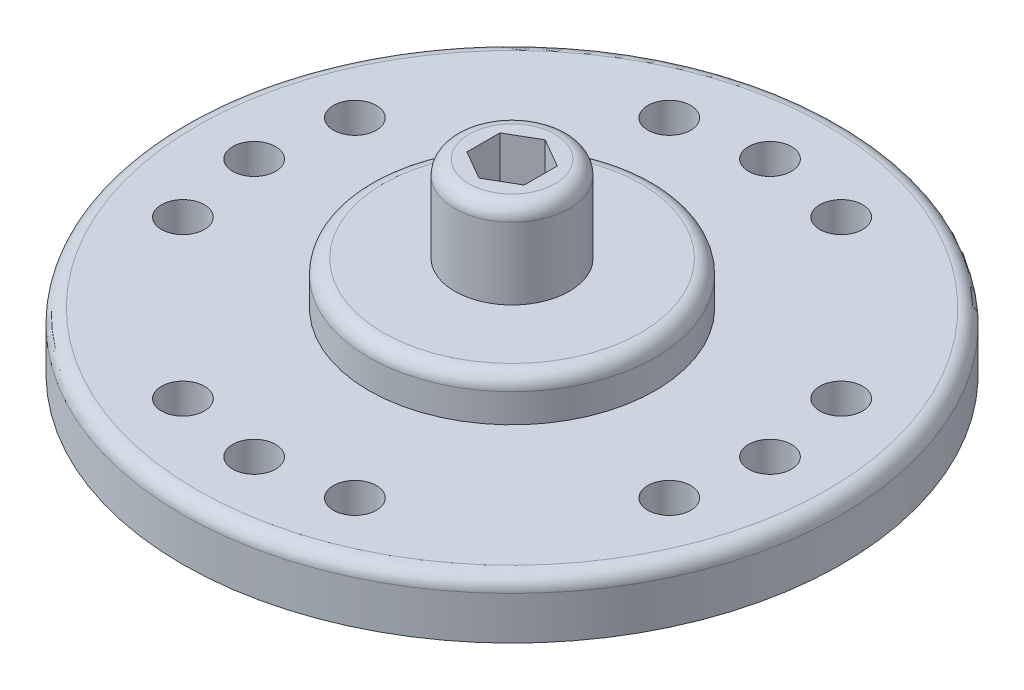
ISO-10303-21;
HEADER;
FILE_DESCRIPTION(('STEP AP214'),'2;1');
FILE_NAME('part.step','',(''),(''),'','','');
FILE_SCHEMA(('AUTOMOTIVE_DESIGN { 1 0 10303 214 1 1 1 1 }'));
ENDSEC;
DATA;
#1=APPLICATION_CONTEXT('core data for automotive mechanical design processes');
#2=APPLICATION_PROTOCOL_DEFINITION('international standard','automotive_design',2000,#1);
#3=PRODUCT_CONTEXT('',#1,'mechanical');
#4=PRODUCT('Part','Part','',(#3));
#5=PRODUCT_RELATED_PRODUCT_CATEGORY('part','',(#4));
#6=PRODUCT_DEFINITION_FORMATION('','',#4);
#7=PRODUCT_DEFINITION_CONTEXT('part definition',#1,'design');
#8=PRODUCT_DEFINITION('design','',#6,#7);
#9=PRODUCT_DEFINITION_SHAPE('','',#8);
#10=(LENGTH_UNIT() NAMED_UNIT(*) SI_UNIT(.MILLI.,.METRE.));
#11=(NAMED_UNIT(*) PLANE_ANGLE_UNIT() SI_UNIT($,.RADIAN.));
#12=(NAMED_UNIT(*) SI_UNIT($,.STERADIAN.) SOLID_ANGLE_UNIT());
#13=UNCERTAINTY_MEASURE_WITH_UNIT(LENGTH_MEASURE(1.E-05),#10,'distance_accuracy_value','');
#14=(GEOMETRIC_REPRESENTATION_CONTEXT(3) GLOBAL_UNCERTAINTY_ASSIGNED_CONTEXT((#13)) GLOBAL_UNIT_ASSIGNED_CONTEXT((#10,
#11,#12)) REPRESENTATION_CONTEXT('',''));
#15=CARTESIAN_POINT('',(0.,0.,0.));
#16=DIRECTION('',(0.,0.,1.));
#17=DIRECTION('',(1.,0.,0.));
#18=AXIS2_PLACEMENT_3D('',#15,#16,#17);
#19=CARTESIAN_POINT('',(0.,3.5,-13.3));
#20=DIRECTION('',(0.,1.,0.));
#21=DIRECTION('',(0.,0.,1.));
#22=AXIS2_PLACEMENT_3D('',#19,#20,#21);
#23=PLANE('',#22);
#24=CARTESIAN_POINT('',(0.,3.5,-13.3));
#25=DIRECTION('',(0.,1.,0.));
#26=DIRECTION('',(0.,0.,1.));
#27=AXIS2_PLACEMENT_3D('',#24,#25,#26);
#28=CIRCLE('',#27,4.5);
#29=CARTESIAN_POINT('',(0.,3.5,-8.79999999999999));
#30=VERTEX_POINT('',#29);
#31=EDGE_CURVE('E251',#30,#30,#28,.T.);
#32=ORIENTED_EDGE('',*,*,#31,.T.);
#33=EDGE_LOOP('',(#32));
#34=FACE_BOUND('',#33,.T.);
#35=CARTESIAN_POINT('',(0.,3.5,-13.3));
#36=DIRECTION('',(0.,1.,0.));
#37=DIRECTION('',(0.,0.,1.));
#38=AXIS2_PLACEMENT_3D('',#35,#36,#37);
#39=CIRCLE('',#38,2.);
#40=CARTESIAN_POINT('',(0.,3.5,-11.3));
#41=VERTEX_POINT('',#40);
#42=EDGE_CURVE('E157',#41,#41,#39,.T.);
#43=ORIENTED_EDGE('',*,*,#42,.F.);
#44=EDGE_LOOP('',(#43));
#45=FACE_BOUND('',#44,.T.);
#46=ADVANCED_FACE('F56',(#34,#45),#23,.T.);
#47=CARTESIAN_POINT('',(0.,2.,-13.3));
#48=DIRECTION('',(0.,1.,0.));
#49=DIRECTION('',(0.,0.,1.));
#50=AXIS2_PLACEMENT_3D('',#47,#48,#49);
#51=PLANE('',#50);
#52=CARTESIAN_POINT('',(0.,2.,-13.3));
#53=DIRECTION('',(0.,1.,0.));
#54=DIRECTION('',(0.,0.,1.));
#55=AXIS2_PLACEMENT_3D('',#52,#53,#54);
#56=CIRCLE('',#55,11.);
#57=CARTESIAN_POINT('',(0.,2.,-2.3));
#58=VERTEX_POINT('',#57);
#59=EDGE_CURVE('E257',#58,#58,#56,.T.);
#60=ORIENTED_EDGE('',*,*,#59,.T.);
#61=EDGE_LOOP('',(#60));
#62=FACE_BOUND('',#61,.T.);
#63=CARTESIAN_POINT('',(8.48528137423861,2.,-10.3000000000001));
#64=DIRECTION('',(0.,1.,0.));
#65=DIRECTION('',(0.,0.,1.));
#66=AXIS2_PLACEMENT_3D('',#63,#64,#65);
#67=CIRCLE('',#66,0.75);
#68=CARTESIAN_POINT('',(8.48528137423861,2.,-9.55000000000008));
#69=VERTEX_POINT('',#68);
#70=EDGE_CURVE('E179',#69,#69,#67,.F.);
#71=ORIENTED_EDGE('',*,*,#70,.T.);
#72=EDGE_LOOP('',(#71));
#73=FACE_BOUND('',#72,.T.);
#74=CARTESIAN_POINT('',(-3.,2.,-4.81471862576142));
#75=DIRECTION('',(0.,1.,0.));
#76=DIRECTION('',(0.,0.,1.));
#77=AXIS2_PLACEMENT_3D('',#74,#75,#76);
#78=CIRCLE('',#77,0.75);
#79=CARTESIAN_POINT('',(-3.,2.,-4.06471862576142));
#80=VERTEX_POINT('',#79);
#81=EDGE_CURVE('E197',#80,#80,#78,.F.);
#82=ORIENTED_EDGE('',*,*,#81,.T.);
#83=EDGE_LOOP('',(#82));
#84=FACE_BOUND('',#83,.T.);
#85=CARTESIAN_POINT('',(-8.48528137423858,2.,-16.3));
#86=DIRECTION('',(0.,1.,0.));
#87=DIRECTION('',(0.,0.,1.));
#88=AXIS2_PLACEMENT_3D('',#85,#86,#87);
#89=CIRCLE('',#88,0.75);
#90=CARTESIAN_POINT('',(-8.48528137423858,2.,-15.55));
#91=VERTEX_POINT('',#90);
#92=EDGE_CURVE('E215',#91,#91,#89,.F.);
#93=ORIENTED_EDGE('',*,*,#92,.T.);
#94=EDGE_LOOP('',(#93));
#95=FACE_BOUND('',#94,.T.);
#96=CARTESIAN_POINT('',(3.,2.,-21.7852813742386));
#97=DIRECTION('',(0.,1.,0.));
#98=DIRECTION('',(0.,0.,1.));
#99=AXIS2_PLACEMENT_3D('',#96,#97,#98);
#100=CIRCLE('',#99,0.75);
#101=CARTESIAN_POINT('',(3.,2.,-21.0352813742386));
#102=VERTEX_POINT('',#101);
#103=EDGE_CURVE('E233',#102,#102,#100,.F.);
#104=ORIENTED_EDGE('',*,*,#103,.T.);
#105=EDGE_LOOP('',(#104));
#106=FACE_BOUND('',#105,.T.);
#107=CARTESIAN_POINT('',(0.,2.,-22.3));
#108=DIRECTION('',(0.,1.,0.));
#109=DIRECTION('',(0.,0.,1.));
#110=AXIS2_PLACEMENT_3D('',#107,#108,#109);
#111=CIRCLE('',#110,0.750000000000001);
#112=CARTESIAN_POINT('',(0.,2.,-21.55));
#113=VERTEX_POINT('',#112);
#114=EDGE_CURVE('E239',#113,#113,#111,.F.);
#115=ORIENTED_EDGE('',*,*,#114,.T.);
#116=EDGE_LOOP('',(#115));
#117=FACE_BOUND('',#116,.T.);
#118=CARTESIAN_POINT('',(-3.,2.,-21.7852813742386));
#119=DIRECTION('',(0.,1.,0.));
#120=DIRECTION('',(0.,0.,1.));
#121=AXIS2_PLACEMENT_3D('',#118,#119,#120);
#122=CIRCLE('',#121,0.75);
#123=CARTESIAN_POINT('',(-3.,2.,-21.0352813742386));
#124=VERTEX_POINT('',#123);
#125=EDGE_CURVE('E227',#124,#124,#122,.T.);
#126=ORIENTED_EDGE('',*,*,#125,.F.);
#127=EDGE_LOOP('',(#126));
#128=FACE_BOUND('',#127,.T.);
#129=CARTESIAN_POINT('',(-9.,2.,-13.3));
#130=DIRECTION('',(0.,1.,0.));
#131=DIRECTION('',(0.,0.,1.));
#132=AXIS2_PLACEMENT_3D('',#129,#130,#131);
#133=CIRCLE('',#132,0.750000000000001);
#134=CARTESIAN_POINT('',(-9.,2.,-12.55));
#135=VERTEX_POINT('',#134);
#136=EDGE_CURVE('E221',#135,#135,#133,.F.);
#137=ORIENTED_EDGE('',*,*,#136,.T.);
#138=EDGE_LOOP('',(#137));
#139=FACE_BOUND('',#138,.T.);
#140=CARTESIAN_POINT('',(-8.48528137423856,2.,-10.3));
#141=DIRECTION('',(0.,1.,0.));
#142=DIRECTION('',(0.,0.,1.));
#143=AXIS2_PLACEMENT_3D('',#140,#141,#142);
#144=CIRCLE('',#143,0.75);
#145=CARTESIAN_POINT('',(-8.48528137423856,2.,-9.54999999999997));
#146=VERTEX_POINT('',#145);
#147=EDGE_CURVE('E209',#146,#146,#144,.T.);
#148=ORIENTED_EDGE('',*,*,#147,.F.);
#149=EDGE_LOOP('',(#148));
#150=FACE_BOUND('',#149,.T.);
#151=CARTESIAN_POINT('',(0.,2.,-4.3));
#152=DIRECTION('',(0.,1.,0.));
#153=DIRECTION('',(0.,0.,1.));
#154=AXIS2_PLACEMENT_3D('',#151,#152,#153);
#155=CIRCLE('',#154,0.750000000000001);
#156=CARTESIAN_POINT('',(0.,2.,-3.55));
#157=VERTEX_POINT('',#156);
#158=EDGE_CURVE('E203',#157,#157,#155,.F.);
#159=ORIENTED_EDGE('',*,*,#158,.T.);
#160=EDGE_LOOP('',(#159));
#161=FACE_BOUND('',#160,.T.);
#162=CARTESIAN_POINT('',(3.,2.,-4.81471862576142));
#163=DIRECTION('',(0.,1.,0.));
#164=DIRECTION('',(0.,0.,1.));
#165=AXIS2_PLACEMENT_3D('',#162,#163,#164);
#166=CIRCLE('',#165,0.75);
#167=CARTESIAN_POINT('',(3.,2.,-4.06471862576142));
#168=VERTEX_POINT('',#167);
#169=EDGE_CURVE('E191',#168,#168,#166,.T.);
#170=ORIENTED_EDGE('',*,*,#169,.F.);
#171=EDGE_LOOP('',(#170));
#172=FACE_BOUND('',#171,.T.);
#173=CARTESIAN_POINT('',(9.,2.,-13.3000000000001));
#174=DIRECTION('',(0.,1.,0.));
#175=DIRECTION('',(0.,0.,1.));
#176=AXIS2_PLACEMENT_3D('',#173,#174,#175);
#177=CIRCLE('',#176,0.750000000000001);
#178=CARTESIAN_POINT('',(9.,2.,-12.5500000000001));
#179=VERTEX_POINT('',#178);
#180=EDGE_CURVE('E185',#179,#179,#177,.F.);
#181=ORIENTED_EDGE('',*,*,#180,.T.);
#182=EDGE_LOOP('',(#181));
#183=FACE_BOUND('',#182,.T.);
#184=CARTESIAN_POINT('',(8.48528137423854,2.,-16.3000000000001));
#185=DIRECTION('',(0.,1.,0.));
#186=DIRECTION('',(0.,0.,1.));
#187=AXIS2_PLACEMENT_3D('',#184,#185,#186);
#188=CIRCLE('',#187,0.75);
#189=CARTESIAN_POINT('',(8.48528137423854,2.,-15.5500000000001));
#190=VERTEX_POINT('',#189);
#191=EDGE_CURVE('E173',#190,#190,#188,.T.);
#192=ORIENTED_EDGE('',*,*,#191,.F.);
#193=EDGE_LOOP('',(#192));
#194=FACE_BOUND('',#193,.T.);
#195=CARTESIAN_POINT('',(0.,2.,-13.3));
#196=DIRECTION('',(0.,1.,0.));
#197=DIRECTION('',(0.,0.,1.));
#198=AXIS2_PLACEMENT_3D('',#195,#196,#197);
#199=CIRCLE('',#198,5.);
#200=CARTESIAN_POINT('',(0.,2.,-8.29999999999999));
#201=VERTEX_POINT('',#200);
#202=EDGE_CURVE('E167',#201,#201,#199,.T.);
#203=ORIENTED_EDGE('',*,*,#202,.F.);
#204=EDGE_LOOP('',(#203));
#205=FACE_BOUND('',#204,.T.);
#206=ADVANCED_FACE('F271',(#62,#73,#84,#95,#106,#117,#128,#139,#150,#161,#172,#183,#194,#205),
#51,.T.);
#207=CARTESIAN_POINT('',(0.,0.,-13.3));
#208=DIRECTION('',(0.,1.,0.));
#209=DIRECTION('',(0.,0.,1.));
#210=AXIS2_PLACEMENT_3D('',#207,#208,#209);
#211=PLANE('',#210);
#212=CARTESIAN_POINT('',(0.,0.,-13.3));
#213=DIRECTION('',(0.,1.,0.));
#214=DIRECTION('',(0.,0.,1.));
#215=AXIS2_PLACEMENT_3D('',#212,#213,#214);
#216=CIRCLE('',#215,5.);
#217=CARTESIAN_POINT('',(0.,0.,-8.29999999999999));
#218=VERTEX_POINT('',#217);
#219=EDGE_CURVE('E133',#218,#218,#216,.T.);
#220=ORIENTED_EDGE('',*,*,#219,.T.);
#221=EDGE_LOOP('',(#220));
#222=FACE_BOUND('',#221,.T.);
#223=CARTESIAN_POINT('',(8.48528137423854,0.,-16.3000000000001));
#224=DIRECTION('',(0.,-1.,0.));
#225=DIRECTION('',(1.,0.,0.));
#226=AXIS2_PLACEMENT_3D('',#223,#224,#225);
#227=CIRCLE('',#226,0.75);
#228=CARTESIAN_POINT('',(9.23528137423854,0.,-16.3000000000001));
#229=VERTEX_POINT('',#228);
#230=EDGE_CURVE('E170',#229,#229,#227,.T.);
#231=ORIENTED_EDGE('',*,*,#230,.F.);
#232=EDGE_LOOP('',(#231));
#233=FACE_BOUND('',#232,.T.);
#234=CARTESIAN_POINT('',(9.,0.,-13.3000000000001));
#235=DIRECTION('',(0.,1.,0.));
#236=DIRECTION('',(-1.,0.,0.));
#237=AXIS2_PLACEMENT_3D('',#234,#235,#236);
#238=CIRCLE('',#237,0.750000000000001);
#239=CARTESIAN_POINT('',(8.25,0.,-13.3000000000001));
#240=VERTEX_POINT('',#239);
#241=EDGE_CURVE('E182',#240,#240,#238,.T.);
#242=ORIENTED_EDGE('',*,*,#241,.T.);
#243=EDGE_LOOP('',(#242));
#244=FACE_BOUND('',#243,.T.);
#245=CARTESIAN_POINT('',(3.,0.,-4.81471862576142));
#246=DIRECTION('',(0.,-1.,0.));
#247=DIRECTION('',(0.,0.,1.));
#248=AXIS2_PLACEMENT_3D('',#245,#246,#247);
#249=CIRCLE('',#248,0.75);
#250=CARTESIAN_POINT('',(3.,0.,-4.06471862576142));
#251=VERTEX_POINT('',#250);
#252=EDGE_CURVE('E188',#251,#251,#249,.T.);
#253=ORIENTED_EDGE('',*,*,#252,.F.);
#254=EDGE_LOOP('',(#253));
#255=FACE_BOUND('',#254,.T.);
#256=CARTESIAN_POINT('',(0.,0.,-4.3));
#257=DIRECTION('',(0.,1.,0.));
#258=DIRECTION('',(0.,0.,-1.));
#259=AXIS2_PLACEMENT_3D('',#256,#257,#258);
#260=CIRCLE('',#259,0.750000000000001);
#261=CARTESIAN_POINT('',(0.,0.,-5.05));
#262=VERTEX_POINT('',#261);
#263=EDGE_CURVE('E200',#262,#262,#260,.T.);
#264=ORIENTED_EDGE('',*,*,#263,.T.);
#265=EDGE_LOOP('',(#264));
#266=FACE_BOUND('',#265,.T.);
#267=CARTESIAN_POINT('',(-8.48528137423856,0.,-10.3));
#268=DIRECTION('',(0.,-1.,0.));
#269=DIRECTION('',(-1.,0.,0.));
#270=AXIS2_PLACEMENT_3D('',#267,#268,#269);
#271=CIRCLE('',#270,0.75);
#272=CARTESIAN_POINT('',(-9.23528137423856,0.,-10.3));
#273=VERTEX_POINT('',#272);
#274=EDGE_CURVE('E206',#273,#273,#271,.T.);
#275=ORIENTED_EDGE('',*,*,#274,.F.);
#276=EDGE_LOOP('',(#275));
#277=FACE_BOUND('',#276,.T.);
#278=CARTESIAN_POINT('',(-9.,0.,-13.3));
#279=DIRECTION('',(0.,1.,0.));
#280=DIRECTION('',(1.,0.,0.));
#281=AXIS2_PLACEMENT_3D('',#278,#279,#280);
#282=CIRCLE('',#281,0.750000000000001);
#283=CARTESIAN_POINT('',(-8.24999999999999,0.,-13.3));
#284=VERTEX_POINT('',#283);
#285=EDGE_CURVE('E218',#284,#284,#282,.T.);
#286=ORIENTED_EDGE('',*,*,#285,.T.);
#287=EDGE_LOOP('',(#286));
#288=FACE_BOUND('',#287,.T.);
#289=CARTESIAN_POINT('',(-3.,0.,-21.7852813742386));
#290=DIRECTION('',(0.,-1.,0.));
#291=DIRECTION('',(0.,0.,-1.));
#292=AXIS2_PLACEMENT_3D('',#289,#290,#291);
#293=CIRCLE('',#292,0.75);
#294=CARTESIAN_POINT('',(-3.,0.,-22.5352813742386));
#295=VERTEX_POINT('',#294);
#296=EDGE_CURVE('E224',#295,#295,#293,.T.);
#297=ORIENTED_EDGE('',*,*,#296,.F.);
#298=EDGE_LOOP('',(#297));
#299=FACE_BOUND('',#298,.T.);
#300=CARTESIAN_POINT('',(0.,0.,-22.3));
#301=DIRECTION('',(0.,1.,0.));
#302=DIRECTION('',(0.,0.,1.));
#303=AXIS2_PLACEMENT_3D('',#300,#301,#302);
#304=CIRCLE('',#303,0.750000000000001);
#305=CARTESIAN_POINT('',(0.,0.,-21.55));
#306=VERTEX_POINT('',#305);
#307=EDGE_CURVE('E236',#306,#306,#304,.T.);
#308=ORIENTED_EDGE('',*,*,#307,.T.);
#309=EDGE_LOOP('',(#308));
#310=FACE_BOUND('',#309,.T.);
#311=CARTESIAN_POINT('',(0.,0.,-13.3));
#312=DIRECTION('',(0.,1.,0.));
#313=DIRECTION('',(0.,0.,1.));
#314=AXIS2_PLACEMENT_3D('',#311,#312,#313);
#315=CIRCLE('',#314,11.5);
#316=CARTESIAN_POINT('',(0.,0.,-1.8));
#317=VERTEX_POINT('',#316);
#318=EDGE_CURVE('E242',#317,#317,#315,.T.);
#319=ORIENTED_EDGE('',*,*,#318,.F.);
#320=EDGE_LOOP('',(#319));
#321=FACE_BOUND('',#320,.T.);
#322=CARTESIAN_POINT('',(3.,0.,-21.7852813742386));
#323=DIRECTION('',(0.,1.,0.));
#324=DIRECTION('',(0.,0.,1.));
#325=AXIS2_PLACEMENT_3D('',#322,#323,#324);
#326=CIRCLE('',#325,0.75);
#327=CARTESIAN_POINT('',(3.,0.,-21.0352813742386));
#328=VERTEX_POINT('',#327);
#329=EDGE_CURVE('E230',#328,#328,#326,.T.);
#330=ORIENTED_EDGE('',*,*,#329,.T.);
#331=EDGE_LOOP('',(#330));
#332=FACE_BOUND('',#331,.T.);
#333=CARTESIAN_POINT('',(-8.48528137423858,0.,-16.3));
#334=DIRECTION('',(0.,1.,0.));
#335=DIRECTION('',(1.,0.,0.));
#336=AXIS2_PLACEMENT_3D('',#333,#334,#335);
#337=CIRCLE('',#336,0.75);
#338=CARTESIAN_POINT('',(-7.73528137423858,0.,-16.3));
#339=VERTEX_POINT('',#338);
#340=EDGE_CURVE('E212',#339,#339,#337,.T.);
#341=ORIENTED_EDGE('',*,*,#340,.T.);
#342=EDGE_LOOP('',(#341));
#343=FACE_BOUND('',#342,.T.);
#344=CARTESIAN_POINT('',(-3.,0.,-4.81471862576142));
#345=DIRECTION('',(0.,1.,0.));
#346=DIRECTION('',(0.,0.,-1.));
#347=AXIS2_PLACEMENT_3D('',#344,#345,#346);
#348=CIRCLE('',#347,0.75);
#349=CARTESIAN_POINT('',(-3.,0.,-5.56471862576142));
#350=VERTEX_POINT('',#349);
#351=EDGE_CURVE('E194',#350,#350,#348,.T.);
#352=ORIENTED_EDGE('',*,*,#351,.T.);
#353=EDGE_LOOP('',(#352));
#354=FACE_BOUND('',#353,.T.);
#355=CARTESIAN_POINT('',(8.48528137423861,0.,-10.3000000000001));
#356=DIRECTION('',(0.,1.,0.));
#357=DIRECTION('',(-1.,0.,0.));
#358=AXIS2_PLACEMENT_3D('',#355,#356,#357);
#359=CIRCLE('',#358,0.75);
#360=CARTESIAN_POINT('',(7.7352813742386,0.,-10.3000000000001));
#361=VERTEX_POINT('',#360);
#362=EDGE_CURVE('E176',#361,#361,#359,.T.);
#363=ORIENTED_EDGE('',*,*,#362,.T.);
#364=EDGE_LOOP('',(#363));
#365=FACE_BOUND('',#364,.T.);
#366=ADVANCED_FACE('F274',(#222,#233,#244,#255,#266,#277,#288,#299,#310,#321,#332,#343,#354,
#365),#211,.F.);
#367=CARTESIAN_POINT('',(0.,2.,-13.3));
#368=DIRECTION('',(0.,-1.,0.));
#369=DIRECTION('',(0.,0.,-1.));
#370=AXIS2_PLACEMENT_3D('',#367,#368,#369);
#371=CYLINDRICAL_SURFACE('',#370,11.5);
#372=CARTESIAN_POINT('',(0.,1.5,-13.3));
#373=DIRECTION('',(0.,1.,0.));
#374=DIRECTION('',(0.,0.,1.));
#375=AXIS2_PLACEMENT_3D('',#372,#373,#374);
#376=CIRCLE('',#375,11.5);
#377=CARTESIAN_POINT('',(0.,1.5,-1.8));
#378=VERTEX_POINT('',#377);
#379=EDGE_CURVE('E64',#378,#378,#376,.F.);
#380=ORIENTED_EDGE('',*,*,#379,.T.);
#381=EDGE_LOOP('',(#380));
#382=FACE_BOUND('',#381,.T.);
#383=ORIENTED_EDGE('',*,*,#318,.T.);
#384=EDGE_LOOP('',(#383));
#385=FACE_BOUND('',#384,.T.);
#386=ADVANCED_FACE('F262',(#382,#385),#371,.T.);
#387=CARTESIAN_POINT('',(0.,3.,-22.3));
#388=DIRECTION('',(0.,-1.,0.));
#389=DIRECTION('',(0.,0.,-1.));
#390=AXIS2_PLACEMENT_3D('',#387,#388,#389);
#391=CYLINDRICAL_SURFACE('',#390,0.750000000000001);
#392=ORIENTED_EDGE('',*,*,#114,.F.);
#393=EDGE_LOOP('',(#392));
#394=FACE_BOUND('',#393,.T.);
#395=ORIENTED_EDGE('',*,*,#307,.F.);
#396=EDGE_LOOP('',(#395));
#397=FACE_BOUND('',#396,.T.);
#398=ADVANCED_FACE('F433',(#394,#397),#391,.F.);
#399=CARTESIAN_POINT('',(3.,3.,-21.7852813742386));
#400=DIRECTION('',(0.,-1.,0.));
#401=DIRECTION('',(0.,0.,-1.));
#402=AXIS2_PLACEMENT_3D('',#399,#400,#401);
#403=CYLINDRICAL_SURFACE('',#402,0.75);
#404=ORIENTED_EDGE('',*,*,#103,.F.);
#405=EDGE_LOOP('',(#404));
#406=FACE_BOUND('',#405,.T.);
#407=ORIENTED_EDGE('',*,*,#329,.F.);
#408=EDGE_LOOP('',(#407));
#409=FACE_BOUND('',#408,.T.);
#410=ADVANCED_FACE('F453',(#406,#409),#403,.F.);
#411=CARTESIAN_POINT('',(-3.,3.,-21.7852813742386));
#412=DIRECTION('',(0.,-1.,0.));
#413=DIRECTION('',(0.,0.,-1.));
#414=AXIS2_PLACEMENT_3D('',#411,#412,#413);
#415=CYLINDRICAL_SURFACE('',#414,0.75);
#416=ORIENTED_EDGE('',*,*,#125,.T.);
#417=EDGE_LOOP('',(#416));
#418=FACE_BOUND('',#417,.T.);
#419=ORIENTED_EDGE('',*,*,#296,.T.);
#420=EDGE_LOOP('',(#419));
#421=FACE_BOUND('',#420,.T.);
#422=ADVANCED_FACE('F460',(#418,#421),#415,.F.);
#423=CARTESIAN_POINT('',(-9.,3.,-13.3));
#424=DIRECTION('',(0.,-1.,0.));
#425=DIRECTION('',(0.,0.,-1.));
#426=AXIS2_PLACEMENT_3D('',#423,#424,#425);
#427=CYLINDRICAL_SURFACE('',#426,0.750000000000001);
#428=ORIENTED_EDGE('',*,*,#136,.F.);
#429=EDGE_LOOP('',(#428));
#430=FACE_BOUND('',#429,.T.);
#431=ORIENTED_EDGE('',*,*,#285,.F.);
#432=EDGE_LOOP('',(#431));
#433=FACE_BOUND('',#432,.T.);
#434=ADVANCED_FACE('F468',(#430,#433),#427,.F.);
#435=CARTESIAN_POINT('',(-8.48528137423858,3.,-16.3));
#436=DIRECTION('',(0.,-1.,0.));
#437=DIRECTION('',(0.,0.,-1.));
#438=AXIS2_PLACEMENT_3D('',#435,#436,#437);
#439=CYLINDRICAL_SURFACE('',#438,0.75);
#440=ORIENTED_EDGE('',*,*,#92,.F.);
#441=EDGE_LOOP('',(#440));
#442=FACE_BOUND('',#441,.T.);
#443=ORIENTED_EDGE('',*,*,#340,.F.);
#444=EDGE_LOOP('',(#443));
#445=FACE_BOUND('',#444,.T.);
#446=ADVANCED_FACE('F476',(#442,#445),#439,.F.);
#447=CARTESIAN_POINT('',(-8.48528137423856,3.,-10.3));
#448=DIRECTION('',(0.,-1.,0.));
#449=DIRECTION('',(0.,0.,-1.));
#450=AXIS2_PLACEMENT_3D('',#447,#448,#449);
#451=CYLINDRICAL_SURFACE('',#450,0.75);
#452=ORIENTED_EDGE('',*,*,#147,.T.);
#453=EDGE_LOOP('',(#452));
#454=FACE_BOUND('',#453,.T.);
#455=ORIENTED_EDGE('',*,*,#274,.T.);
#456=EDGE_LOOP('',(#455));
#457=FACE_BOUND('',#456,.T.);
#458=ADVANCED_FACE('F484',(#454,#457),#451,.F.);
#459=CARTESIAN_POINT('',(0.,3.,-4.3));
#460=DIRECTION('',(0.,-1.,0.));
#461=DIRECTION('',(0.,0.,-1.));
#462=AXIS2_PLACEMENT_3D('',#459,#460,#461);
#463=CYLINDRICAL_SURFACE('',#462,0.750000000000001);
#464=ORIENTED_EDGE('',*,*,#158,.F.);
#465=EDGE_LOOP('',(#464));
#466=FACE_BOUND('',#465,.T.);
#467=ORIENTED_EDGE('',*,*,#263,.F.);
#468=EDGE_LOOP('',(#467));
#469=FACE_BOUND('',#468,.T.);
#470=ADVANCED_FACE('F492',(#466,#469),#463,.F.);
#471=CARTESIAN_POINT('',(-3.,3.,-4.81471862576142));
#472=DIRECTION('',(0.,-1.,0.));
#473=DIRECTION('',(0.,0.,-1.));
#474=AXIS2_PLACEMENT_3D('',#471,#472,#473);
#475=CYLINDRICAL_SURFACE('',#474,0.75);
#476=ORIENTED_EDGE('',*,*,#81,.F.);
#477=EDGE_LOOP('',(#476));
#478=FACE_BOUND('',#477,.T.);
#479=ORIENTED_EDGE('',*,*,#351,.F.);
#480=EDGE_LOOP('',(#479));
#481=FACE_BOUND('',#480,.T.);
#482=ADVANCED_FACE('F500',(#478,#481),#475,.F.);
#483=CARTESIAN_POINT('',(3.,3.,-4.81471862576142));
#484=DIRECTION('',(0.,-1.,0.));
#485=DIRECTION('',(0.,0.,-1.));
#486=AXIS2_PLACEMENT_3D('',#483,#484,#485);
#487=CYLINDRICAL_SURFACE('',#486,0.75);
#488=ORIENTED_EDGE('',*,*,#169,.T.);
#489=EDGE_LOOP('',(#488));
#490=FACE_BOUND('',#489,.T.);
#491=ORIENTED_EDGE('',*,*,#252,.T.);
#492=EDGE_LOOP('',(#491));
#493=FACE_BOUND('',#492,.T.);
#494=ADVANCED_FACE('F508',(#490,#493),#487,.F.);
#495=CARTESIAN_POINT('',(9.,3.,-13.3000000000001));
#496=DIRECTION('',(0.,-1.,0.));
#497=DIRECTION('',(0.,0.,-1.));
#498=AXIS2_PLACEMENT_3D('',#495,#496,#497);
#499=CYLINDRICAL_SURFACE('',#498,0.750000000000001);
#500=ORIENTED_EDGE('',*,*,#180,.F.);
#501=EDGE_LOOP('',(#500));
#502=FACE_BOUND('',#501,.T.);
#503=ORIENTED_EDGE('',*,*,#241,.F.);
#504=EDGE_LOOP('',(#503));
#505=FACE_BOUND('',#504,.T.);
#506=ADVANCED_FACE('F516',(#502,#505),#499,.F.);
#507=CARTESIAN_POINT('',(8.48528137423861,3.,-10.3000000000001));
#508=DIRECTION('',(0.,-1.,0.));
#509=DIRECTION('',(0.,0.,-1.));
#510=AXIS2_PLACEMENT_3D('',#507,#508,#509);
#511=CYLINDRICAL_SURFACE('',#510,0.75);
#512=ORIENTED_EDGE('',*,*,#70,.F.);
#513=EDGE_LOOP('',(#512));
#514=FACE_BOUND('',#513,.T.);
#515=ORIENTED_EDGE('',*,*,#362,.F.);
#516=EDGE_LOOP('',(#515));
#517=FACE_BOUND('',#516,.T.);
#518=ADVANCED_FACE('F314',(#514,#517),#511,.F.);
#519=CARTESIAN_POINT('',(8.48528137423854,3.,-16.3000000000001));
#520=DIRECTION('',(0.,-1.,0.));
#521=DIRECTION('',(0.,0.,-1.));
#522=AXIS2_PLACEMENT_3D('',#519,#520,#521);
#523=CYLINDRICAL_SURFACE('',#522,0.75);
#524=ORIENTED_EDGE('',*,*,#191,.T.);
#525=EDGE_LOOP('',(#524));
#526=FACE_BOUND('',#525,.T.);
#527=ORIENTED_EDGE('',*,*,#230,.T.);
#528=EDGE_LOOP('',(#527));
#529=FACE_BOUND('',#528,.T.);
#530=ADVANCED_FACE('F305',(#526,#529),#523,.F.);
#531=CARTESIAN_POINT('',(0.,3.5,-13.3));
#532=DIRECTION('',(0.,-1.,0.));
#533=DIRECTION('',(0.,0.,-1.));
#534=AXIS2_PLACEMENT_3D('',#531,#532,#533);
#535=CYLINDRICAL_SURFACE('',#534,5.);
#536=CARTESIAN_POINT('',(0.,3.,-13.3));
#537=DIRECTION('',(0.,1.,0.));
#538=DIRECTION('',(0.,0.,1.));
#539=AXIS2_PLACEMENT_3D('',#536,#537,#538);
#540=CIRCLE('',#539,5.);
#541=CARTESIAN_POINT('',(0.,3.,-8.29999999999999));
#542=VERTEX_POINT('',#541);
#543=EDGE_CURVE('E254',#542,#542,#540,.F.);
#544=ORIENTED_EDGE('',*,*,#543,.T.);
#545=EDGE_LOOP('',(#544));
#546=FACE_BOUND('',#545,.T.);
#547=ORIENTED_EDGE('',*,*,#202,.T.);
#548=EDGE_LOOP('',(#547));
#549=FACE_BOUND('',#548,.T.);
#550=ADVANCED_FACE('F302',(#546,#549),#535,.T.);
#551=CARTESIAN_POINT('',(0.,6.5,-13.3));
#552=DIRECTION('',(0.,-1.,0.));
#553=DIRECTION('',(0.,0.,-1.));
#554=AXIS2_PLACEMENT_3D('',#551,#552,#553);
#555=CYLINDRICAL_SURFACE('',#554,2.);
#556=CARTESIAN_POINT('',(0.,6.,-13.3));
#557=DIRECTION('',(0.,1.,0.));
#558=DIRECTION('',(0.,0.,1.));
#559=AXIS2_PLACEMENT_3D('',#556,#557,#558);
#560=CIRCLE('',#559,2.);
#561=CARTESIAN_POINT('',(0.,6.,-11.3));
#562=VERTEX_POINT('',#561);
#563=EDGE_CURVE('E248',#562,#562,#560,.F.);
#564=ORIENTED_EDGE('',*,*,#563,.T.);
#565=EDGE_LOOP('',(#564));
#566=FACE_BOUND('',#565,.T.);
#567=ORIENTED_EDGE('',*,*,#42,.T.);
#568=EDGE_LOOP('',(#567));
#569=FACE_BOUND('',#568,.T.);
#570=ADVANCED_FACE('F304',(#566,#569),#555,.T.);
#571=CARTESIAN_POINT('',(0.,6.5,-13.3));
#572=DIRECTION('',(0.,1.,0.));
#573=DIRECTION('',(0.,0.,1.));
#574=AXIS2_PLACEMENT_3D('',#571,#572,#573);
#575=PLANE('',#574);
#576=CARTESIAN_POINT('',(0.,6.5,-13.3));
#577=DIRECTION('',(0.,1.,0.));
#578=DIRECTION('',(0.,0.,1.));
#579=AXIS2_PLACEMENT_3D('',#576,#577,#578);
#580=CIRCLE('',#579,1.5);
#581=CARTESIAN_POINT('',(0.,6.5,-11.8));
#582=VERTEX_POINT('',#581);
#583=EDGE_CURVE('E245',#582,#582,#580,.T.);
#584=ORIENTED_EDGE('',*,*,#583,.T.);
#585=EDGE_LOOP('',(#584));
#586=FACE_BOUND('',#585,.T.);
#587=DIRECTION('',(0.,0.,1.));
#588=VECTOR('',#587,1.);
#589=CARTESIAN_POINT('',(1.00000000000001,6.5,-13.3));
#590=LINE('',#589,#588);
#591=CARTESIAN_POINT('',(1.00000000000001,6.5,-13.8773502691896));
#592=VERTEX_POINT('',#591);
#593=CARTESIAN_POINT('',(1.00000000000001,6.5,-12.7226497308104));
#594=VERTEX_POINT('',#593);
#595=EDGE_CURVE('E111',#592,#594,#590,.T.);
#596=ORIENTED_EDGE('',*,*,#595,.T.);
#597=DIRECTION('',(-0.866025403784439,0.,0.5));
#598=VECTOR('',#597,1.);
#599=CARTESIAN_POINT('',(0.500000000000004,6.5,-12.4339745962156));
#600=LINE('',#599,#598);
#601=CARTESIAN_POINT('',(0.,6.5,-12.1452994616207));
#602=VERTEX_POINT('',#601);
#603=EDGE_CURVE('E120',#594,#602,#600,.T.);
#604=ORIENTED_EDGE('',*,*,#603,.T.);
#605=DIRECTION('',(-0.866025403784439,0.,-0.499999999999999));
#606=VECTOR('',#605,1.);
#607=CARTESIAN_POINT('',(-0.499999999999997,6.5,-12.4339745962156));
#608=LINE('',#607,#606);
#609=CARTESIAN_POINT('',(-1.00000000000001,6.5,-12.7226497308104));
#610=VERTEX_POINT('',#609);
#611=EDGE_CURVE('E79',#602,#610,#608,.T.);
#612=ORIENTED_EDGE('',*,*,#611,.T.);
#613=DIRECTION('',(0.,0.,-1.));
#614=VECTOR('',#613,1.);
#615=CARTESIAN_POINT('',(-1.00000000000001,6.5,-13.3));
#616=LINE('',#615,#614);
#617=CARTESIAN_POINT('',(-1.00000000000001,6.5,-13.8773502691896));
#618=VERTEX_POINT('',#617);
#619=EDGE_CURVE('E137',#610,#618,#616,.T.);
#620=ORIENTED_EDGE('',*,*,#619,.T.);
#621=DIRECTION('',(0.866025403784439,0.,-0.5));
#622=VECTOR('',#621,1.);
#623=CARTESIAN_POINT('',(-0.500000000000002,6.5,-14.1660254037844));
#624=LINE('',#623,#622);
#625=CARTESIAN_POINT('',(0.,6.5,-14.4547005383793));
#626=VERTEX_POINT('',#625);
#627=EDGE_CURVE('E140',#618,#626,#624,.T.);
#628=ORIENTED_EDGE('',*,*,#627,.T.);
#629=DIRECTION('',(0.866025403784439,0.,0.5));
#630=VECTOR('',#629,1.);
#631=CARTESIAN_POINT('',(0.500000000000004,6.5,-14.1660254037844));
#632=LINE('',#631,#630);
#633=EDGE_CURVE('E117',#626,#592,#632,.T.);
#634=ORIENTED_EDGE('',*,*,#633,.T.);
#635=EDGE_LOOP('',(#596,#604,#612,#620,#628,#634));
#636=FACE_BOUND('',#635,.T.);
#637=ADVANCED_FACE('F124',(#586,#636),#575,.T.);
#638=CARTESIAN_POINT('',(1.00000000000001,6.5,-13.3));
#639=DIRECTION('',(1.,0.,0.));
#640=DIRECTION('',(0.,0.,-1.));
#641=AXIS2_PLACEMENT_3D('',#638,#639,#640);
#642=PLANE('',#641);
#643=DIRECTION('',(0.,0.,1.));
#644=VECTOR('',#643,1.);
#645=CARTESIAN_POINT('',(1.00000000000001,3.5,-13.3));
#646=LINE('',#645,#644);
#647=CARTESIAN_POINT('',(1.00000000000001,3.5,-13.8773502691896));
#648=VERTEX_POINT('',#647);
#649=CARTESIAN_POINT('',(1.00000000000001,3.5,-12.7226497308104));
#650=VERTEX_POINT('',#649);
#651=EDGE_CURVE('E114',#648,#650,#646,.T.);
#652=ORIENTED_EDGE('',*,*,#651,.T.);
#653=DIRECTION('',(0.,-1.,0.));
#654=VECTOR('',#653,1.);
#655=CARTESIAN_POINT('',(1.00000000000001,6.5,-12.7226497308104));
#656=LINE('',#655,#654);
#657=EDGE_CURVE('E71',#594,#650,#656,.T.);
#658=ORIENTED_EDGE('',*,*,#657,.F.);
#659=ORIENTED_EDGE('',*,*,#595,.F.);
#660=DIRECTION('',(0.,-1.,0.));
#661=VECTOR('',#660,1.);
#662=CARTESIAN_POINT('',(1.00000000000001,6.5,-13.8773502691896));
#663=LINE('',#662,#661);
#664=EDGE_CURVE('E155',#592,#648,#663,.T.);
#665=ORIENTED_EDGE('',*,*,#664,.T.);
#666=EDGE_LOOP('',(#652,#658,#659,#665));
#667=FACE_BOUND('',#666,.T.);
#668=ADVANCED_FACE('F109',(#667),#642,.F.);
#669=CARTESIAN_POINT('',(0.500000000000004,6.5,-14.1660254037844));
#670=DIRECTION('',(0.5,0.,-0.866025403784439));
#671=DIRECTION('',(-0.866025403784439,0.,-0.5));
#672=AXIS2_PLACEMENT_3D('',#669,#670,#671);
#673=PLANE('',#672);
#674=DIRECTION('',(0.866025403784439,0.,0.5));
#675=VECTOR('',#674,1.);
#676=CARTESIAN_POINT('',(0.500000000000004,3.5,-14.1660254037844));
#677=LINE('',#676,#675);
#678=CARTESIAN_POINT('',(0.,3.5,-14.4547005383793));
#679=VERTEX_POINT('',#678);
#680=EDGE_CURVE('E127',#679,#648,#677,.T.);
#681=ORIENTED_EDGE('',*,*,#680,.T.);
#682=ORIENTED_EDGE('',*,*,#664,.F.);
#683=ORIENTED_EDGE('',*,*,#633,.F.);
#684=DIRECTION('',(0.,-1.,0.));
#685=VECTOR('',#684,1.);
#686=CARTESIAN_POINT('',(0.,6.5,-14.4547005383793));
#687=LINE('',#686,#685);
#688=EDGE_CURVE('E158',#626,#679,#687,.T.);
#689=ORIENTED_EDGE('',*,*,#688,.T.);
#690=EDGE_LOOP('',(#681,#682,#683,#689));
#691=FACE_BOUND('',#690,.T.);
#692=ADVANCED_FACE('F346',(#691),#673,.F.);
#693=CARTESIAN_POINT('',(-0.500000000000002,6.5,-14.1660254037844));
#694=DIRECTION('',(-0.5,0.,-0.866025403784438));
#695=DIRECTION('',(-0.866025403784439,0.,0.5));
#696=AXIS2_PLACEMENT_3D('',#693,#694,#695);
#697=PLANE('',#696);
#698=DIRECTION('',(0.866025403784439,0.,-0.5));
#699=VECTOR('',#698,1.);
#700=CARTESIAN_POINT('',(-0.500000000000002,3.5,-14.1660254037844));
#701=LINE('',#700,#699);
#702=CARTESIAN_POINT('',(-1.00000000000001,3.5,-13.8773502691896));
#703=VERTEX_POINT('',#702);
#704=EDGE_CURVE('E130',#703,#679,#701,.T.);
#705=ORIENTED_EDGE('',*,*,#704,.T.);
#706=ORIENTED_EDGE('',*,*,#688,.F.);
#707=ORIENTED_EDGE('',*,*,#627,.F.);
#708=DIRECTION('',(0.,-1.,0.));
#709=VECTOR('',#708,1.);
#710=CARTESIAN_POINT('',(-1.00000000000001,6.5,-13.8773502691896));
#711=LINE('',#710,#709);
#712=EDGE_CURVE('E160',#618,#703,#711,.T.);
#713=ORIENTED_EDGE('',*,*,#712,.T.);
#714=EDGE_LOOP('',(#705,#706,#707,#713));
#715=FACE_BOUND('',#714,.T.);
#716=ADVANCED_FACE('F344',(#715),#697,.F.);
#717=CARTESIAN_POINT('',(-1.00000000000001,6.5,-13.3));
#718=DIRECTION('',(-1.,0.,0.));
#719=DIRECTION('',(0.,0.,1.));
#720=AXIS2_PLACEMENT_3D('',#717,#718,#719);
#721=PLANE('',#720);
#722=DIRECTION('',(0.,0.,-1.));
#723=VECTOR('',#722,1.);
#724=CARTESIAN_POINT('',(-1.00000000000001,3.5,-13.3));
#725=LINE('',#724,#723);
#726=CARTESIAN_POINT('',(-1.00000000000001,3.5,-12.7226497308104));
#727=VERTEX_POINT('',#726);
#728=EDGE_CURVE('E150',#727,#703,#725,.T.);
#729=ORIENTED_EDGE('',*,*,#728,.T.);
#730=ORIENTED_EDGE('',*,*,#712,.F.);
#731=ORIENTED_EDGE('',*,*,#619,.F.);
#732=DIRECTION('',(0.,-1.,0.));
#733=VECTOR('',#732,1.);
#734=CARTESIAN_POINT('',(-1.00000000000001,6.5,-12.7226497308104));
#735=LINE('',#734,#733);
#736=EDGE_CURVE('E162',#610,#727,#735,.T.);
#737=ORIENTED_EDGE('',*,*,#736,.T.);
#738=EDGE_LOOP('',(#729,#730,#731,#737));
#739=FACE_BOUND('',#738,.T.);
#740=ADVANCED_FACE('F341',(#739),#721,.F.);
#741=CARTESIAN_POINT('',(-0.499999999999997,6.5,-12.4339745962156));
#742=DIRECTION('',(-0.499999999999999,0.,0.866025403784439));
#743=DIRECTION('',(0.866025403784439,0.,0.499999999999999));
#744=AXIS2_PLACEMENT_3D('',#741,#742,#743);
#745=PLANE('',#744);
#746=DIRECTION('',(-0.866025403784439,0.,-0.499999999999999));
#747=VECTOR('',#746,1.);
#748=CARTESIAN_POINT('',(-0.499999999999997,3.5,-12.4339745962156));
#749=LINE('',#748,#747);
#750=CARTESIAN_POINT('',(0.,3.5,-12.1452994616207));
#751=VERTEX_POINT('',#750);
#752=EDGE_CURVE('E147',#751,#727,#749,.T.);
#753=ORIENTED_EDGE('',*,*,#752,.T.);
#754=ORIENTED_EDGE('',*,*,#736,.F.);
#755=ORIENTED_EDGE('',*,*,#611,.F.);
#756=DIRECTION('',(0.,-1.,0.));
#757=VECTOR('',#756,1.);
#758=CARTESIAN_POINT('',(0.,6.5,-12.1452994616207));
#759=LINE('',#758,#757);
#760=EDGE_CURVE('E116',#602,#751,#759,.T.);
#761=ORIENTED_EDGE('',*,*,#760,.T.);
#762=EDGE_LOOP('',(#753,#754,#755,#761));
#763=FACE_BOUND('',#762,.T.);
#764=ADVANCED_FACE('F333',(#763),#745,.F.);
#765=CARTESIAN_POINT('',(0.500000000000004,6.5,-12.4339745962156));
#766=DIRECTION('',(0.5,0.,0.866025403784439));
#767=DIRECTION('',(0.866025403784439,0.,-0.5));
#768=AXIS2_PLACEMENT_3D('',#765,#766,#767);
#769=PLANE('',#768);
#770=DIRECTION('',(-0.866025403784439,0.,0.5));
#771=VECTOR('',#770,1.);
#772=CARTESIAN_POINT('',(0.500000000000004,3.5,-12.4339745962156));
#773=LINE('',#772,#771);
#774=EDGE_CURVE('E144',#650,#751,#773,.T.);
#775=ORIENTED_EDGE('',*,*,#774,.T.);
#776=ORIENTED_EDGE('',*,*,#760,.F.);
#777=ORIENTED_EDGE('',*,*,#603,.F.);
#778=ORIENTED_EDGE('',*,*,#657,.T.);
#779=EDGE_LOOP('',(#775,#776,#777,#778));
#780=FACE_BOUND('',#779,.T.);
#781=ADVANCED_FACE('F121',(#780),#769,.F.);
#782=ORIENTED_EDGE('',*,*,#774,.F.);
#783=ORIENTED_EDGE('',*,*,#651,.F.);
#784=ORIENTED_EDGE('',*,*,#680,.F.);
#785=ORIENTED_EDGE('',*,*,#704,.F.);
#786=ORIENTED_EDGE('',*,*,#728,.F.);
#787=ORIENTED_EDGE('',*,*,#752,.F.);
#788=EDGE_LOOP('',(#782,#783,#784,#785,#786,#787));
#789=FACE_BOUND('',#788,.T.);
#790=ADVANCED_FACE('F320',(#789),#23,.T.);
#791=CARTESIAN_POINT('',(0.,6.,-13.3));
#792=DIRECTION('',(0.,1.,0.));
#793=DIRECTION('',(0.,0.,1.));
#794=AXIS2_PLACEMENT_3D('',#791,#792,#793);
#795=TOROIDAL_SURFACE('',#794,1.5,0.5);
#796=ORIENTED_EDGE('',*,*,#563,.F.);
#797=EDGE_LOOP('',(#796));
#798=FACE_BOUND('',#797,.T.);
#799=ORIENTED_EDGE('',*,*,#583,.F.);
#800=EDGE_LOOP('',(#799));
#801=FACE_BOUND('',#800,.T.);
#802=ADVANCED_FACE('F325',(#798,#801),#795,.T.);
#803=CARTESIAN_POINT('',(0.,3.,-13.3));
#804=DIRECTION('',(0.,1.,0.));
#805=DIRECTION('',(0.,0.,1.));
#806=AXIS2_PLACEMENT_3D('',#803,#804,#805);
#807=TOROIDAL_SURFACE('',#806,4.5,0.5);
#808=ORIENTED_EDGE('',*,*,#543,.F.);
#809=EDGE_LOOP('',(#808));
#810=FACE_BOUND('',#809,.T.);
#811=ORIENTED_EDGE('',*,*,#31,.F.);
#812=EDGE_LOOP('',(#811));
#813=FACE_BOUND('',#812,.T.);
#814=ADVANCED_FACE('F268',(#810,#813),#807,.T.);
#815=CARTESIAN_POINT('',(0.,1.5,-13.3));
#816=DIRECTION('',(0.,1.,0.));
#817=DIRECTION('',(0.,0.,1.));
#818=AXIS2_PLACEMENT_3D('',#815,#816,#817);
#819=TOROIDAL_SURFACE('',#818,11.,0.5);
#820=ORIENTED_EDGE('',*,*,#379,.F.);
#821=EDGE_LOOP('',(#820));
#822=FACE_BOUND('',#821,.T.);
#823=ORIENTED_EDGE('',*,*,#59,.F.);
#824=EDGE_LOOP('',(#823));
#825=FACE_BOUND('',#824,.T.);
#826=ADVANCED_FACE('F58',(#822,#825),#819,.T.);
#827=CARTESIAN_POINT('',(0.,-1.,-13.3));
#828=DIRECTION('',(0.,1.,0.));
#829=DIRECTION('',(0.,0.,1.));
#830=AXIS2_PLACEMENT_3D('',#827,#828,#829);
#831=CYLINDRICAL_SURFACE('',#830,2.);
#832=CARTESIAN_POINT('',(0.,-1.,-13.3));
#833=DIRECTION('',(0.,1.,0.));
#834=DIRECTION('',(0.,0.,1.));
#835=AXIS2_PLACEMENT_3D('',#832,#833,#834);
#836=CIRCLE('',#835,2.);
#837=CARTESIAN_POINT('',(0.,-1.,-11.3));
#838=VERTEX_POINT('',#837);
#839=EDGE_CURVE('E626',#838,#838,#836,.T.);
#840=ORIENTED_EDGE('',*,*,#839,.F.);
#841=EDGE_LOOP('',(#840));
#842=FACE_BOUND('',#841,.T.);
#843=CARTESIAN_POINT('',(0.,0.,-13.3));
#844=DIRECTION('',(0.,1.,0.));
#845=DIRECTION('',(0.,0.,1.));
#846=AXIS2_PLACEMENT_3D('',#843,#844,#845);
#847=CIRCLE('',#846,2.);
#848=CARTESIAN_POINT('',(0.,0.,-11.3));
#849=VERTEX_POINT('',#848);
#850=EDGE_CURVE('E12',#849,#849,#847,.T.);
#851=ORIENTED_EDGE('',*,*,#850,.T.);
#852=EDGE_LOOP('',(#851));
#853=FACE_BOUND('',#852,.T.);
#854=ADVANCED_FACE('F267',(#842,#853),#831,.F.);
#855=CARTESIAN_POINT('',(0.,-1.,-13.3));
#856=DIRECTION('',(0.,1.,0.));
#857=DIRECTION('',(0.,0.,1.));
#858=AXIS2_PLACEMENT_3D('',#855,#856,#857);
#859=CYLINDRICAL_SURFACE('',#858,5.);
#860=CARTESIAN_POINT('',(0.,-1.,-13.3));
#861=DIRECTION('',(0.,1.,0.));
#862=DIRECTION('',(0.,0.,1.));
#863=AXIS2_PLACEMENT_3D('',#860,#861,#862);
#864=CIRCLE('',#863,5.);
#865=CARTESIAN_POINT('',(0.,-1.,-8.29999999999999));
#866=VERTEX_POINT('',#865);
#867=EDGE_CURVE('E145',#866,#866,#864,.T.);
#868=ORIENTED_EDGE('',*,*,#867,.T.);
#869=EDGE_LOOP('',(#868));
#870=FACE_BOUND('',#869,.T.);
#871=ORIENTED_EDGE('',*,*,#219,.F.);
#872=EDGE_LOOP('',(#871));
#873=FACE_BOUND('',#872,.T.);
#874=ADVANCED_FACE('F574',(#870,#873),#859,.T.);
#875=CARTESIAN_POINT('',(0.,-1.,0.));
#876=DIRECTION('',(0.,1.,0.));
#877=DIRECTION('',(0.,0.,1.));
#878=AXIS2_PLACEMENT_3D('',#875,#876,#877);
#879=PLANE('',#878);
#880=ORIENTED_EDGE('',*,*,#839,.T.);
#881=EDGE_LOOP('',(#880));
#882=FACE_BOUND('',#881,.T.);
#883=ORIENTED_EDGE('',*,*,#867,.F.);
#884=EDGE_LOOP('',(#883));
#885=FACE_BOUND('',#884,.T.);
#886=ADVANCED_FACE('F584',(#882,#885),#879,.F.);
#887=ORIENTED_EDGE('',*,*,#850,.F.);
#888=EDGE_LOOP('',(#887));
#889=FACE_BOUND('',#888,.T.);
#890=ADVANCED_FACE('F557',(#889),#211,.F.);
#891=CLOSED_SHELL('',(#46,#206,#366,#386,#398,#410,#422,#434,#446,#458,#470,#482,#494,#506,#518,
#530,#550,#570,#637,#668,#692,#716,#740,#764,#781,#790,#802,#814,#826,#854,#874,#886,#890));
#892=MANIFOLD_SOLID_BREP('B2',#891);
#893=ADVANCED_BREP_SHAPE_REPRESENTATION('',(#18,#892),#14);
#894=SHAPE_DEFINITION_REPRESENTATION(#9,#893);
ENDSEC;
END-ISO-10303-21;
